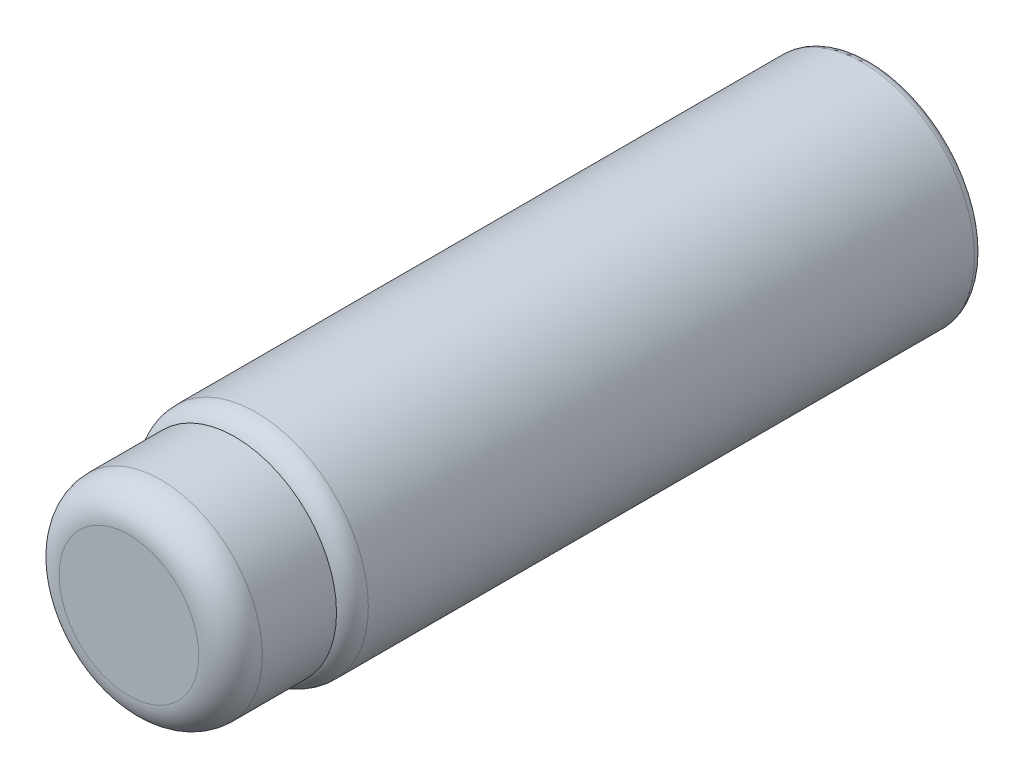
ISO-10303-21;
HEADER;
FILE_DESCRIPTION(('STEP AP214'),'2;1');
FILE_NAME('part.step','',(''),(''),'','','');
FILE_SCHEMA(('AUTOMOTIVE_DESIGN { 1 0 10303 214 1 1 1 1 }'));
ENDSEC;
DATA;
#1=APPLICATION_CONTEXT('core data for automotive mechanical design processes');
#2=APPLICATION_PROTOCOL_DEFINITION('international standard','automotive_design',2000,#1);
#3=PRODUCT_CONTEXT('',#1,'mechanical');
#4=PRODUCT('Part','Part','',(#3));
#5=PRODUCT_RELATED_PRODUCT_CATEGORY('part','',(#4));
#6=PRODUCT_DEFINITION_FORMATION('','',#4);
#7=PRODUCT_DEFINITION_CONTEXT('part definition',#1,'design');
#8=PRODUCT_DEFINITION('design','',#6,#7);
#9=PRODUCT_DEFINITION_SHAPE('','',#8);
#10=(LENGTH_UNIT() NAMED_UNIT(*) SI_UNIT(.MILLI.,.METRE.));
#11=(NAMED_UNIT(*) PLANE_ANGLE_UNIT() SI_UNIT($,.RADIAN.));
#12=(NAMED_UNIT(*) SI_UNIT($,.STERADIAN.) SOLID_ANGLE_UNIT());
#13=UNCERTAINTY_MEASURE_WITH_UNIT(LENGTH_MEASURE(1.E-05),#10,'distance_accuracy_value','');
#14=(GEOMETRIC_REPRESENTATION_CONTEXT(3) GLOBAL_UNCERTAINTY_ASSIGNED_CONTEXT((#13)) GLOBAL_UNIT_ASSIGNED_CONTEXT((#10,
#11,#12)) REPRESENTATION_CONTEXT('',''));
#15=CARTESIAN_POINT('',(0.,0.,0.));
#16=DIRECTION('',(0.,0.,1.));
#17=DIRECTION('',(1.,0.,0.));
#18=AXIS2_PLACEMENT_3D('',#15,#16,#17);
#19=CARTESIAN_POINT('',(0.,0.,300.));
#20=DIRECTION('',(0.,0.,-1.));
#21=DIRECTION('',(-1.,0.,0.));
#22=AXIS2_PLACEMENT_3D('',#19,#20,#21);
#23=CYLINDRICAL_SURFACE('',#22,52.9366417720523);
#24=CARTESIAN_POINT('',(0.,0.,4.));
#25=DIRECTION('',(0.,0.,1.));
#26=DIRECTION('',(1.,0.,0.));
#27=AXIS2_PLACEMENT_3D('',#24,#25,#26);
#28=CIRCLE('',#27,52.9366417720523);
#29=CARTESIAN_POINT('',(52.9366417720523,0.,4.));
#30=VERTEX_POINT('',#29);
#31=EDGE_CURVE('E41',#30,#30,#28,.T.);
#32=ORIENTED_EDGE('',*,*,#31,.T.);
#33=EDGE_LOOP('',(#32));
#34=FACE_BOUND('',#33,.T.);
#35=CARTESIAN_POINT('',(0.,0.,290.));
#36=DIRECTION('',(0.,0.,1.));
#37=DIRECTION('',(1.,0.,0.));
#38=AXIS2_PLACEMENT_3D('',#35,#36,#37);
#39=CIRCLE('',#38,52.9366417720523);
#40=CARTESIAN_POINT('',(52.9366417720523,0.,290.));
#41=VERTEX_POINT('',#40);
#42=EDGE_CURVE('E60',#41,#41,#39,.F.);
#43=ORIENTED_EDGE('',*,*,#42,.T.);
#44=EDGE_LOOP('',(#43));
#45=FACE_BOUND('',#44,.T.);
#46=ADVANCED_FACE('F34',(#34,#45),#23,.T.);
#47=CARTESIAN_POINT('',(0.,0.,0.));
#48=DIRECTION('',(0.,0.,1.));
#49=DIRECTION('',(1.,0.,0.));
#50=AXIS2_PLACEMENT_3D('',#47,#48,#49);
#51=PLANE('',#50);
#52=CARTESIAN_POINT('',(0.,0.,0.));
#53=DIRECTION('',(0.,0.,1.));
#54=DIRECTION('',(1.,0.,0.));
#55=AXIS2_PLACEMENT_3D('',#52,#53,#54);
#56=CIRCLE('',#55,48.9366417720523);
#57=CARTESIAN_POINT('',(48.9366417720523,0.,0.));
#58=VERTEX_POINT('',#57);
#59=EDGE_CURVE('E10',#58,#58,#56,.F.);
#60=ORIENTED_EDGE('',*,*,#59,.T.);
#61=EDGE_LOOP('',(#60));
#62=FACE_BOUND('',#61,.T.);
#63=CARTESIAN_POINT('',(0.,0.,0.));
#64=DIRECTION('',(0.,0.,1.));
#65=DIRECTION('',(1.,0.,0.));
#66=AXIS2_PLACEMENT_3D('',#63,#64,#65);
#67=CIRCLE('',#66,48.9227201627839);
#68=CARTESIAN_POINT('',(48.9227201627839,0.,0.));
#69=VERTEX_POINT('',#68);
#70=EDGE_CURVE('E45',#69,#69,#67,.T.);
#71=ORIENTED_EDGE('',*,*,#70,.T.);
#72=EDGE_LOOP('',(#71));
#73=FACE_BOUND('',#72,.T.);
#74=ADVANCED_FACE('F91',(#62,#73),#51,.F.);
#75=CARTESIAN_POINT('',(0.,0.,290.));
#76=DIRECTION('',(0.,0.,1.));
#77=DIRECTION('',(1.,0.,0.));
#78=AXIS2_PLACEMENT_3D('',#75,#76,#77);
#79=TOROIDAL_SURFACE('',#78,42.9366417720523,10.);
#80=ORIENTED_EDGE('',*,*,#42,.F.);
#81=EDGE_LOOP('',(#80));
#82=FACE_BOUND('',#81,.T.);
#83=CARTESIAN_POINT('',(0.,0.,300.));
#84=DIRECTION('',(0.,0.,1.));
#85=DIRECTION('',(1.,0.,0.));
#86=AXIS2_PLACEMENT_3D('',#83,#84,#85);
#87=CIRCLE('',#86,42.9366417720523);
#88=CARTESIAN_POINT('',(42.9366417720523,0.,300.));
#89=VERTEX_POINT('',#88);
#90=EDGE_CURVE('E63',#89,#89,#87,.T.);
#91=ORIENTED_EDGE('',*,*,#90,.F.);
#92=EDGE_LOOP('',(#91));
#93=FACE_BOUND('',#92,.T.);
#94=ADVANCED_FACE('F96',(#82,#93),#79,.T.);
#95=CARTESIAN_POINT('',(0.,0.,350.));
#96=DIRECTION('',(0.,0.,-1.));
#97=DIRECTION('',(-1.,0.,0.));
#98=AXIS2_PLACEMENT_3D('',#95,#96,#97);
#99=CYLINDRICAL_SURFACE('',#98,47.9366417720523);
#100=CARTESIAN_POINT('',(0.,0.,335.));
#101=DIRECTION('',(0.,0.,1.));
#102=DIRECTION('',(1.,0.,0.));
#103=AXIS2_PLACEMENT_3D('',#100,#101,#102);
#104=CIRCLE('',#103,47.9366417720523);
#105=CARTESIAN_POINT('',(47.9366417720523,0.,335.));
#106=VERTEX_POINT('',#105);
#107=EDGE_CURVE('E54',#106,#106,#104,.F.);
#108=ORIENTED_EDGE('',*,*,#107,.T.);
#109=EDGE_LOOP('',(#108));
#110=FACE_BOUND('',#109,.T.);
#111=CARTESIAN_POINT('',(0.,0.,300.));
#112=DIRECTION('',(0.,0.,1.));
#113=DIRECTION('',(1.,0.,0.));
#114=AXIS2_PLACEMENT_3D('',#111,#112,#113);
#115=CIRCLE('',#114,47.9366417720523);
#116=CARTESIAN_POINT('',(47.9366417720523,0.,300.));
#117=VERTEX_POINT('',#116);
#118=EDGE_CURVE('E66',#117,#117,#115,.T.);
#119=ORIENTED_EDGE('',*,*,#118,.T.);
#120=EDGE_LOOP('',(#119));
#121=FACE_BOUND('',#120,.T.);
#122=ADVANCED_FACE('F102',(#110,#121),#99,.T.);
#123=CARTESIAN_POINT('',(0.,0.,350.));
#124=DIRECTION('',(0.,0.,1.));
#125=DIRECTION('',(1.,0.,0.));
#126=AXIS2_PLACEMENT_3D('',#123,#124,#125);
#127=PLANE('',#126);
#128=CARTESIAN_POINT('',(0.,0.,350.));
#129=DIRECTION('',(0.,0.,1.));
#130=DIRECTION('',(1.,0.,0.));
#131=AXIS2_PLACEMENT_3D('',#128,#129,#130);
#132=CIRCLE('',#131,32.9366417720523);
#133=CARTESIAN_POINT('',(32.9366417720523,0.,350.));
#134=VERTEX_POINT('',#133);
#135=EDGE_CURVE('E57',#134,#134,#132,.T.);
#136=ORIENTED_EDGE('',*,*,#135,.T.);
#137=EDGE_LOOP('',(#136));
#138=FACE_BOUND('',#137,.T.);
#139=ADVANCED_FACE('F155',(#138),#127,.T.);
#140=CARTESIAN_POINT('',(0.,0.,300.));
#141=DIRECTION('',(0.,0.,1.));
#142=DIRECTION('',(1.,0.,0.));
#143=AXIS2_PLACEMENT_3D('',#140,#141,#142);
#144=PLANE('',#143);
#145=ORIENTED_EDGE('',*,*,#90,.T.);
#146=EDGE_LOOP('',(#145));
#147=FACE_BOUND('',#146,.T.);
#148=ORIENTED_EDGE('',*,*,#118,.F.);
#149=EDGE_LOOP('',(#148));
#150=FACE_BOUND('',#149,.T.);
#151=ADVANCED_FACE('F86',(#147,#150),#144,.F.);
#152=CARTESIAN_POINT('',(0.,0.,335.));
#153=DIRECTION('',(0.,0.,1.));
#154=DIRECTION('',(1.,0.,0.));
#155=AXIS2_PLACEMENT_3D('',#152,#153,#154);
#156=TOROIDAL_SURFACE('',#155,32.9366417720523,15.);
#157=ORIENTED_EDGE('',*,*,#107,.F.);
#158=EDGE_LOOP('',(#157));
#159=FACE_BOUND('',#158,.T.);
#160=ORIENTED_EDGE('',*,*,#135,.F.);
#161=EDGE_LOOP('',(#160));
#162=FACE_BOUND('',#161,.T.);
#163=ADVANCED_FACE('F77',(#159,#162),#156,.T.);
#164=CARTESIAN_POINT('',(0.,0.,10.));
#165=DIRECTION('',(0.,0.,-1.));
#166=DIRECTION('',(-1.,0.,0.));
#167=AXIS2_PLACEMENT_3D('',#164,#165,#166);
#168=CYLINDRICAL_SURFACE('',#167,43.9227201627839);
#169=CARTESIAN_POINT('',(0.,0.,5.));
#170=DIRECTION('',(0.,0.,1.));
#171=DIRECTION('',(1.,0.,0.));
#172=AXIS2_PLACEMENT_3D('',#169,#170,#171);
#173=CIRCLE('',#172,43.9227201627839);
#174=CARTESIAN_POINT('',(43.9227201627839,0.,5.));
#175=VERTEX_POINT('',#174);
#176=EDGE_CURVE('E49',#175,#175,#173,.F.);
#177=ORIENTED_EDGE('',*,*,#176,.T.);
#178=EDGE_LOOP('',(#177));
#179=FACE_BOUND('',#178,.T.);
#180=CARTESIAN_POINT('',(0.,0.,10.));
#181=DIRECTION('',(0.,0.,-1.));
#182=DIRECTION('',(-1.,0.,0.));
#183=AXIS2_PLACEMENT_3D('',#180,#181,#182);
#184=CIRCLE('',#183,43.9227201627839);
#185=CARTESIAN_POINT('',(-43.9227201627839,0.,10.));
#186=VERTEX_POINT('',#185);
#187=EDGE_CURVE('E69',#186,#186,#184,.T.);
#188=ORIENTED_EDGE('',*,*,#187,.F.);
#189=EDGE_LOOP('',(#188));
#190=FACE_BOUND('',#189,.T.);
#191=ADVANCED_FACE('F75',(#179,#190),#168,.F.);
#192=CARTESIAN_POINT('',(0.,0.,10.));
#193=DIRECTION('',(0.,0.,-1.));
#194=DIRECTION('',(-1.,0.,0.));
#195=AXIS2_PLACEMENT_3D('',#192,#193,#194);
#196=PLANE('',#195);
#197=ORIENTED_EDGE('',*,*,#187,.T.);
#198=EDGE_LOOP('',(#197));
#199=FACE_BOUND('',#198,.T.);
#200=ADVANCED_FACE('F73',(#199),#196,.T.);
#201=CARTESIAN_POINT('',(0.,0.,5.));
#202=DIRECTION('',(0.,0.,1.));
#203=DIRECTION('',(1.,0.,0.));
#204=AXIS2_PLACEMENT_3D('',#201,#202,#203);
#205=TOROIDAL_SURFACE('',#204,48.9227201627839,5.);
#206=ORIENTED_EDGE('',*,*,#70,.F.);
#207=EDGE_LOOP('',(#206));
#208=FACE_BOUND('',#207,.T.);
#209=ORIENTED_EDGE('',*,*,#176,.F.);
#210=EDGE_LOOP('',(#209));
#211=FACE_BOUND('',#210,.T.);
#212=ADVANCED_FACE('F84',(#208,#211),#205,.T.);
#213=CARTESIAN_POINT('',(0.,0.,4.));
#214=DIRECTION('',(0.,0.,1.));
#215=DIRECTION('',(1.,0.,0.));
#216=AXIS2_PLACEMENT_3D('',#213,#214,#215);
#217=TOROIDAL_SURFACE('',#216,48.9366417720523,4.);
#218=ORIENTED_EDGE('',*,*,#59,.F.);
#219=EDGE_LOOP('',(#218));
#220=FACE_BOUND('',#219,.T.);
#221=ORIENTED_EDGE('',*,*,#31,.F.);
#222=EDGE_LOOP('',(#221));
#223=FACE_BOUND('',#222,.T.);
#224=ADVANCED_FACE('F36',(#220,#223),#217,.T.);
#225=CLOSED_SHELL('',(#46,#74,#94,#122,#139,#151,#163,#191,#200,#212,#224));
#226=MANIFOLD_SOLID_BREP('B2',#225);
#227=ADVANCED_BREP_SHAPE_REPRESENTATION('',(#18,#226),#14);
#228=SHAPE_DEFINITION_REPRESENTATION(#9,#227);
ENDSEC;
END-ISO-10303-21;
